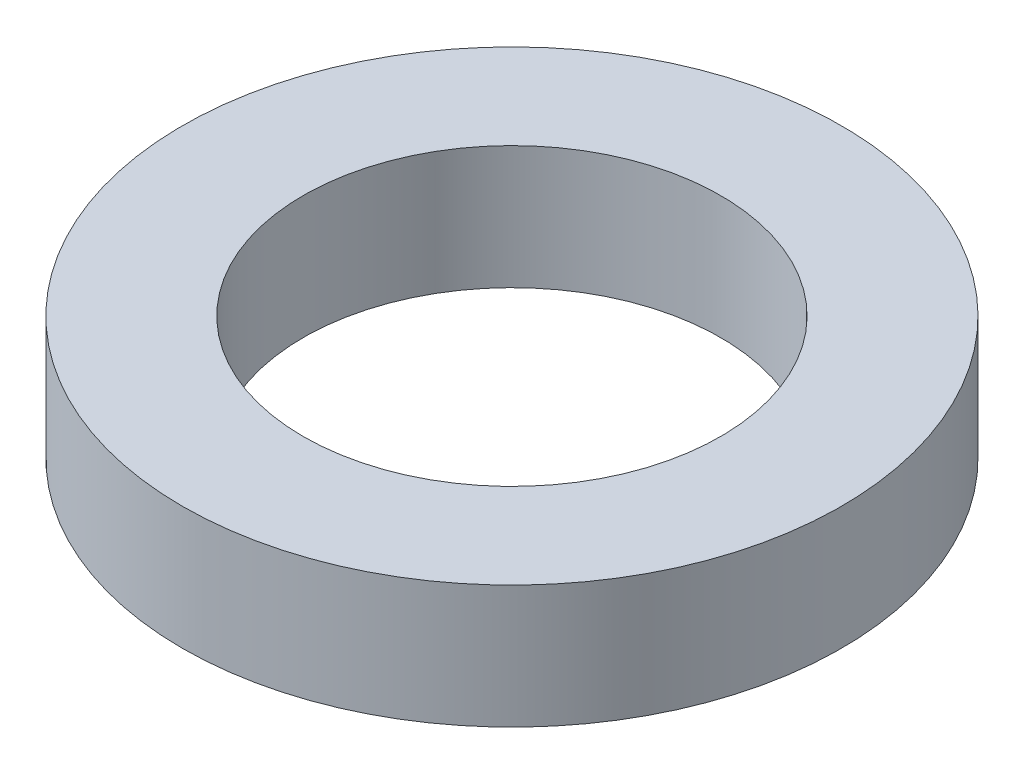
ISO-10303-21;
HEADER;
FILE_DESCRIPTION(('STEP AP214'),'2;1');
FILE_NAME('part.step','',(''),(''),'','','');
FILE_SCHEMA(('AUTOMOTIVE_DESIGN { 1 0 10303 214 1 1 1 1 }'));
ENDSEC;
DATA;
#1=APPLICATION_CONTEXT('core data for automotive mechanical design processes');
#2=APPLICATION_PROTOCOL_DEFINITION('international standard','automotive_design',2000,#1);
#3=PRODUCT_CONTEXT('',#1,'mechanical');
#4=PRODUCT('Part','Part','',(#3));
#5=PRODUCT_RELATED_PRODUCT_CATEGORY('part','',(#4));
#6=PRODUCT_DEFINITION_FORMATION('','',#4);
#7=PRODUCT_DEFINITION_CONTEXT('part definition',#1,'design');
#8=PRODUCT_DEFINITION('design','',#6,#7);
#9=PRODUCT_DEFINITION_SHAPE('','',#8);
#10=(LENGTH_UNIT() NAMED_UNIT(*) SI_UNIT(.MILLI.,.METRE.));
#11=(NAMED_UNIT(*) PLANE_ANGLE_UNIT() SI_UNIT($,.RADIAN.));
#12=(NAMED_UNIT(*) SI_UNIT($,.STERADIAN.) SOLID_ANGLE_UNIT());
#13=UNCERTAINTY_MEASURE_WITH_UNIT(LENGTH_MEASURE(1.E-05),#10,'distance_accuracy_value','');
#14=(GEOMETRIC_REPRESENTATION_CONTEXT(3) GLOBAL_UNCERTAINTY_ASSIGNED_CONTEXT((#13)) GLOBAL_UNIT_ASSIGNED_CONTEXT((#10,
#11,#12)) REPRESENTATION_CONTEXT('',''));
#15=CARTESIAN_POINT('',(0.,0.,0.));
#16=DIRECTION('',(0.,0.,1.));
#17=DIRECTION('',(1.,0.,0.));
#18=AXIS2_PLACEMENT_3D('',#15,#16,#17);
#19=CARTESIAN_POINT('',(0.,28.,0.));
#20=DIRECTION('',(0.,-1.,0.));
#21=DIRECTION('',(0.,0.,-1.));
#22=AXIS2_PLACEMENT_3D('',#19,#20,#21);
#23=CYLINDRICAL_SURFACE('',#22,75.);
#24=CARTESIAN_POINT('',(0.,28.,0.));
#25=DIRECTION('',(0.,1.,0.));
#26=DIRECTION('',(0.,0.,1.));
#27=AXIS2_PLACEMENT_3D('',#24,#25,#26);
#28=CIRCLE('',#27,75.);
#29=CARTESIAN_POINT('',(0.,28.,75.));
#30=VERTEX_POINT('',#29);
#31=EDGE_CURVE('E10',#30,#30,#28,.T.);
#32=ORIENTED_EDGE('',*,*,#31,.F.);
#33=EDGE_LOOP('',(#32));
#34=FACE_BOUND('',#33,.T.);
#35=CARTESIAN_POINT('',(0.,0.,0.));
#36=DIRECTION('',(0.,1.,0.));
#37=DIRECTION('',(0.,0.,1.));
#38=AXIS2_PLACEMENT_3D('',#35,#36,#37);
#39=CIRCLE('',#38,75.);
#40=CARTESIAN_POINT('',(0.,0.,75.));
#41=VERTEX_POINT('',#40);
#42=EDGE_CURVE('E37',#41,#41,#39,.T.);
#43=ORIENTED_EDGE('',*,*,#42,.T.);
#44=EDGE_LOOP('',(#43));
#45=FACE_BOUND('',#44,.T.);
#46=ADVANCED_FACE('F40',(#34,#45),#23,.T.);
#47=CARTESIAN_POINT('',(0.,28.,0.));
#48=DIRECTION('',(0.,1.,0.));
#49=DIRECTION('',(0.,0.,1.));
#50=AXIS2_PLACEMENT_3D('',#47,#48,#49);
#51=PLANE('',#50);
#52=CARTESIAN_POINT('',(0.,28.,0.));
#53=DIRECTION('',(0.,1.,0.));
#54=DIRECTION('',(0.,0.,1.));
#55=AXIS2_PLACEMENT_3D('',#52,#53,#54);
#56=CIRCLE('',#55,47.5);
#57=CARTESIAN_POINT('',(0.,28.,47.5));
#58=VERTEX_POINT('',#57);
#59=EDGE_CURVE('E50',#58,#58,#56,.T.);
#60=ORIENTED_EDGE('',*,*,#59,.F.);
#61=EDGE_LOOP('',(#60));
#62=FACE_BOUND('',#61,.T.);
#63=ORIENTED_EDGE('',*,*,#31,.T.);
#64=EDGE_LOOP('',(#63));
#65=FACE_BOUND('',#64,.T.);
#66=ADVANCED_FACE('F59',(#62,#65),#51,.T.);
#67=CARTESIAN_POINT('',(0.,0.,0.));
#68=DIRECTION('',(0.,1.,0.));
#69=DIRECTION('',(0.,0.,1.));
#70=AXIS2_PLACEMENT_3D('',#67,#68,#69);
#71=PLANE('',#70);
#72=CARTESIAN_POINT('',(0.,0.,0.));
#73=DIRECTION('',(0.,1.,0.));
#74=DIRECTION('',(0.,0.,1.));
#75=AXIS2_PLACEMENT_3D('',#72,#73,#74);
#76=CIRCLE('',#75,47.5);
#77=CARTESIAN_POINT('',(0.,0.,47.5));
#78=VERTEX_POINT('',#77);
#79=EDGE_CURVE('E47',#78,#78,#76,.T.);
#80=ORIENTED_EDGE('',*,*,#79,.T.);
#81=EDGE_LOOP('',(#80));
#82=FACE_BOUND('',#81,.T.);
#83=ORIENTED_EDGE('',*,*,#42,.F.);
#84=EDGE_LOOP('',(#83));
#85=FACE_BOUND('',#84,.T.);
#86=ADVANCED_FACE('F58',(#82,#85),#71,.F.);
#87=CARTESIAN_POINT('',(0.,28.,0.));
#88=DIRECTION('',(0.,-1.,0.));
#89=DIRECTION('',(0.,0.,-1.));
#90=AXIS2_PLACEMENT_3D('',#87,#88,#89);
#91=CYLINDRICAL_SURFACE('',#90,47.5);
#92=ORIENTED_EDGE('',*,*,#59,.T.);
#93=EDGE_LOOP('',(#92));
#94=FACE_BOUND('',#93,.T.);
#95=ORIENTED_EDGE('',*,*,#79,.F.);
#96=EDGE_LOOP('',(#95));
#97=FACE_BOUND('',#96,.T.);
#98=ADVANCED_FACE('F54',(#94,#97),#91,.F.);
#99=CLOSED_SHELL('',(#46,#66,#86,#98));
#100=MANIFOLD_SOLID_BREP('B2',#99);
#101=ADVANCED_BREP_SHAPE_REPRESENTATION('',(#18,#100),#14);
#102=SHAPE_DEFINITION_REPRESENTATION(#9,#101);
ENDSEC;
END-ISO-10303-21;
